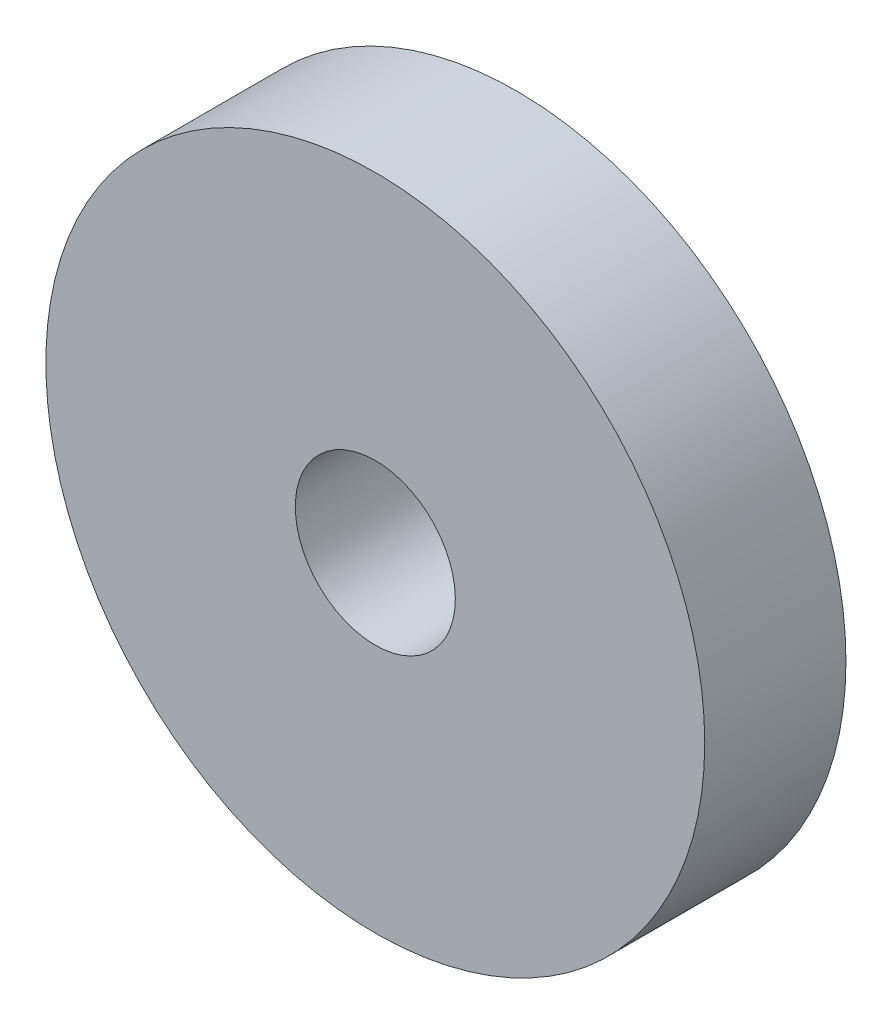
ISO-10303-21;
HEADER;
FILE_DESCRIPTION(('STEP AP214'),'2;1');
FILE_NAME('part.step','',(''),(''),'','','');
FILE_SCHEMA(('AUTOMOTIVE_DESIGN { 1 0 10303 214 1 1 1 1 }'));
ENDSEC;
DATA;
#1=APPLICATION_CONTEXT('core data for automotive mechanical design processes');
#2=APPLICATION_PROTOCOL_DEFINITION('international standard','automotive_design',2000,#1);
#3=PRODUCT_CONTEXT('',#1,'mechanical');
#4=PRODUCT('Part','Part','',(#3));
#5=PRODUCT_RELATED_PRODUCT_CATEGORY('part','',(#4));
#6=PRODUCT_DEFINITION_FORMATION('','',#4);
#7=PRODUCT_DEFINITION_CONTEXT('part definition',#1,'design');
#8=PRODUCT_DEFINITION('design','',#6,#7);
#9=PRODUCT_DEFINITION_SHAPE('','',#8);
#10=(LENGTH_UNIT() NAMED_UNIT(*) SI_UNIT(.MILLI.,.METRE.));
#11=(NAMED_UNIT(*) PLANE_ANGLE_UNIT() SI_UNIT($,.RADIAN.));
#12=(NAMED_UNIT(*) SI_UNIT($,.STERADIAN.) SOLID_ANGLE_UNIT());
#13=UNCERTAINTY_MEASURE_WITH_UNIT(LENGTH_MEASURE(1.E-05),#10,'distance_accuracy_value','');
#14=(GEOMETRIC_REPRESENTATION_CONTEXT(3) GLOBAL_UNCERTAINTY_ASSIGNED_CONTEXT((#13)) GLOBAL_UNIT_ASSIGNED_CONTEXT((#10,
#11,#12)) REPRESENTATION_CONTEXT('',''));
#15=CARTESIAN_POINT('',(0.,0.,0.));
#16=DIRECTION('',(0.,0.,1.));
#17=DIRECTION('',(1.,0.,0.));
#18=AXIS2_PLACEMENT_3D('',#15,#16,#17);
#19=CARTESIAN_POINT('',(0.,0.,3.));
#20=DIRECTION('',(0.,0.,-1.));
#21=DIRECTION('',(-1.,0.,0.));
#22=AXIS2_PLACEMENT_3D('',#19,#20,#21);
#23=CYLINDRICAL_SURFACE('',#22,7.);
#24=CARTESIAN_POINT('',(0.,0.,3.));
#25=DIRECTION('',(0.,0.,1.));
#26=DIRECTION('',(1.,0.,0.));
#27=AXIS2_PLACEMENT_3D('',#24,#25,#26);
#28=CIRCLE('',#27,7.);
#29=CARTESIAN_POINT('',(7.,0.,3.));
#30=VERTEX_POINT('',#29);
#31=EDGE_CURVE('E10',#30,#30,#28,.T.);
#32=ORIENTED_EDGE('',*,*,#31,.F.);
#33=EDGE_LOOP('',(#32));
#34=FACE_BOUND('',#33,.T.);
#35=CARTESIAN_POINT('',(0.,0.,0.));
#36=DIRECTION('',(0.,0.,1.));
#37=DIRECTION('',(1.,0.,0.));
#38=AXIS2_PLACEMENT_3D('',#35,#36,#37);
#39=CIRCLE('',#38,7.);
#40=CARTESIAN_POINT('',(7.,0.,0.));
#41=VERTEX_POINT('',#40);
#42=EDGE_CURVE('E44',#41,#41,#39,.T.);
#43=ORIENTED_EDGE('',*,*,#42,.T.);
#44=EDGE_LOOP('',(#43));
#45=FACE_BOUND('',#44,.T.);
#46=ADVANCED_FACE('F41',(#34,#45),#23,.T.);
#47=CARTESIAN_POINT('',(0.,0.,3.));
#48=DIRECTION('',(0.,0.,1.));
#49=DIRECTION('',(1.,0.,0.));
#50=AXIS2_PLACEMENT_3D('',#47,#48,#49);
#51=PLANE('',#50);
#52=CARTESIAN_POINT('',(0.,0.,3.));
#53=DIRECTION('',(0.,0.,1.));
#54=DIRECTION('',(1.,0.,0.));
#55=AXIS2_PLACEMENT_3D('',#52,#53,#54);
#56=CIRCLE('',#55,1.7);
#57=CARTESIAN_POINT('',(1.7,0.,3.));
#58=VERTEX_POINT('',#57);
#59=EDGE_CURVE('E58',#58,#58,#56,.T.);
#60=ORIENTED_EDGE('',*,*,#59,.F.);
#61=EDGE_LOOP('',(#60));
#62=FACE_BOUND('',#61,.T.);
#63=ORIENTED_EDGE('',*,*,#31,.T.);
#64=EDGE_LOOP('',(#63));
#65=FACE_BOUND('',#64,.T.);
#66=ADVANCED_FACE('F65',(#62,#65),#51,.T.);
#67=CARTESIAN_POINT('',(0.,0.,0.));
#68=DIRECTION('',(0.,0.,1.));
#69=DIRECTION('',(1.,0.,0.));
#70=AXIS2_PLACEMENT_3D('',#67,#68,#69);
#71=PLANE('',#70);
#72=CARTESIAN_POINT('',(0.,0.,0.));
#73=DIRECTION('',(0.,0.,1.));
#74=DIRECTION('',(1.,0.,0.));
#75=AXIS2_PLACEMENT_3D('',#72,#73,#74);
#76=CIRCLE('',#75,1.7);
#77=CARTESIAN_POINT('',(1.7,0.,0.));
#78=VERTEX_POINT('',#77);
#79=EDGE_CURVE('E53',#78,#78,#76,.F.);
#80=ORIENTED_EDGE('',*,*,#79,.F.);
#81=EDGE_LOOP('',(#80));
#82=FACE_BOUND('',#81,.T.);
#83=ORIENTED_EDGE('',*,*,#42,.F.);
#84=EDGE_LOOP('',(#83));
#85=FACE_BOUND('',#84,.T.);
#86=ADVANCED_FACE('F67',(#82,#85),#71,.F.);
#87=CARTESIAN_POINT('',(0.,0.,-4.80832611206852));
#88=DIRECTION('',(0.,0.,1.));
#89=DIRECTION('',(1.,0.,0.));
#90=AXIS2_PLACEMENT_3D('',#87,#88,#89);
#91=CYLINDRICAL_SURFACE('',#90,1.7);
#92=ORIENTED_EDGE('',*,*,#79,.T.);
#93=EDGE_LOOP('',(#92));
#94=FACE_BOUND('',#93,.T.);
#95=ORIENTED_EDGE('',*,*,#59,.T.);
#96=EDGE_LOOP('',(#95));
#97=FACE_BOUND('',#96,.T.);
#98=ADVANCED_FACE('F63',(#94,#97),#91,.F.);
#99=CLOSED_SHELL('',(#46,#66,#86,#98));
#100=MANIFOLD_SOLID_BREP('B2',#99);
#101=ADVANCED_BREP_SHAPE_REPRESENTATION('',(#18,#100),#14);
#102=SHAPE_DEFINITION_REPRESENTATION(#9,#101);
ENDSEC;
END-ISO-10303-21;
